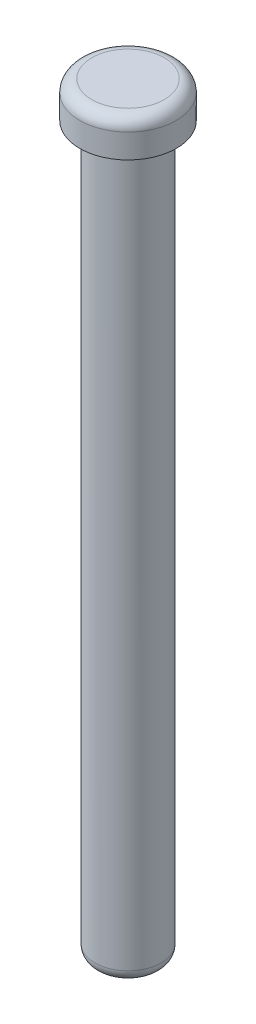
ISO-10303-21;
HEADER;
FILE_DESCRIPTION(('STEP AP214'),'2;1');
FILE_NAME('part.step','',(''),(''),'','','');
FILE_SCHEMA(('AUTOMOTIVE_DESIGN { 1 0 10303 214 1 1 1 1 }'));
ENDSEC;
DATA;
#1=APPLICATION_CONTEXT('core data for automotive mechanical design processes');
#2=APPLICATION_PROTOCOL_DEFINITION('international standard','automotive_design',2000,#1);
#3=PRODUCT_CONTEXT('',#1,'mechanical');
#4=PRODUCT('Part','Part','',(#3));
#5=PRODUCT_RELATED_PRODUCT_CATEGORY('part','',(#4));
#6=PRODUCT_DEFINITION_FORMATION('','',#4);
#7=PRODUCT_DEFINITION_CONTEXT('part definition',#1,'design');
#8=PRODUCT_DEFINITION('design','',#6,#7);
#9=PRODUCT_DEFINITION_SHAPE('','',#8);
#10=(LENGTH_UNIT() NAMED_UNIT(*) SI_UNIT(.MILLI.,.METRE.));
#11=(NAMED_UNIT(*) PLANE_ANGLE_UNIT() SI_UNIT($,.RADIAN.));
#12=(NAMED_UNIT(*) SI_UNIT($,.STERADIAN.) SOLID_ANGLE_UNIT());
#13=UNCERTAINTY_MEASURE_WITH_UNIT(LENGTH_MEASURE(1.E-05),#10,'distance_accuracy_value','');
#14=(GEOMETRIC_REPRESENTATION_CONTEXT(3) GLOBAL_UNCERTAINTY_ASSIGNED_CONTEXT((#13)) GLOBAL_UNIT_ASSIGNED_CONTEXT((#10,
#11,#12)) REPRESENTATION_CONTEXT('',''));
#15=CARTESIAN_POINT('',(0.,0.,0.));
#16=DIRECTION('',(0.,0.,1.));
#17=DIRECTION('',(1.,0.,0.));
#18=AXIS2_PLACEMENT_3D('',#15,#16,#17);
#19=CARTESIAN_POINT('',(-2.75,0.,0.));
#20=DIRECTION('',(0.,1.,0.));
#21=DIRECTION('',(0.,0.,1.));
#22=AXIS2_PLACEMENT_3D('',#19,#20,#21);
#23=PLANE('',#22);
#24=CARTESIAN_POINT('',(0.,0.,0.));
#25=DIRECTION('',(0.,1.,0.));
#26=DIRECTION('',(0.,0.,1.));
#27=AXIS2_PLACEMENT_3D('',#24,#25,#26);
#28=CIRCLE('',#27,1.75);
#29=CARTESIAN_POINT('',(0.,0.,1.75));
#30=VERTEX_POINT('',#29);
#31=EDGE_CURVE('E55',#30,#30,#28,.F.);
#32=ORIENTED_EDGE('',*,*,#31,.T.);
#33=EDGE_LOOP('',(#32));
#34=FACE_BOUND('',#33,.T.);
#35=ADVANCED_FACE('F37',(#34),#23,.F.);
#36=CARTESIAN_POINT('',(0.,63.,0.));
#37=DIRECTION('',(0.,-1.,0.));
#38=DIRECTION('',(0.,0.,-1.));
#39=AXIS2_PLACEMENT_3D('',#36,#37,#38);
#40=PLANE('',#39);
#41=CARTESIAN_POINT('',(0.,63.,0.));
#42=DIRECTION('',(0.,-1.,0.));
#43=DIRECTION('',(0.,0.,-1.));
#44=AXIS2_PLACEMENT_3D('',#41,#42,#43);
#45=CIRCLE('',#44,3.);
#46=CARTESIAN_POINT('',(0.,63.,-3.));
#47=VERTEX_POINT('',#46);
#48=EDGE_CURVE('E10',#47,#47,#45,.F.);
#49=ORIENTED_EDGE('',*,*,#48,.T.);
#50=EDGE_LOOP('',(#49));
#51=FACE_BOUND('',#50,.T.);
#52=ADVANCED_FACE('F80',(#51),#40,.F.);
#53=CARTESIAN_POINT('',(0.,0.,0.));
#54=DIRECTION('',(0.,-1.,0.));
#55=DIRECTION('',(0.,0.,-1.));
#56=AXIS2_PLACEMENT_3D('',#53,#54,#55);
#57=CYLINDRICAL_SURFACE('',#56,4.);
#58=CARTESIAN_POINT('',(0.,62.,0.));
#59=DIRECTION('',(0.,-1.,0.));
#60=DIRECTION('',(0.,0.,-1.));
#61=AXIS2_PLACEMENT_3D('',#58,#59,#60);
#62=CIRCLE('',#61,4.);
#63=CARTESIAN_POINT('',(0.,62.,-4.));
#64=VERTEX_POINT('',#63);
#65=EDGE_CURVE('E45',#64,#64,#62,.T.);
#66=ORIENTED_EDGE('',*,*,#65,.T.);
#67=EDGE_LOOP('',(#66));
#68=FACE_BOUND('',#67,.T.);
#69=CARTESIAN_POINT('',(0.,60.,0.));
#70=DIRECTION('',(0.,-1.,0.));
#71=DIRECTION('',(0.,0.,-1.));
#72=AXIS2_PLACEMENT_3D('',#69,#70,#71);
#73=CIRCLE('',#72,4.);
#74=CARTESIAN_POINT('',(0.,60.,-4.));
#75=VERTEX_POINT('',#74);
#76=EDGE_CURVE('E61',#75,#75,#73,.T.);
#77=ORIENTED_EDGE('',*,*,#76,.F.);
#78=EDGE_LOOP('',(#77));
#79=FACE_BOUND('',#78,.T.);
#80=ADVANCED_FACE('F75',(#68,#79),#57,.T.);
#81=CARTESIAN_POINT('',(-4.,60.,0.));
#82=DIRECTION('',(0.,1.,0.));
#83=DIRECTION('',(0.,0.,1.));
#84=AXIS2_PLACEMENT_3D('',#81,#82,#83);
#85=PLANE('',#84);
#86=CARTESIAN_POINT('',(0.,60.,0.));
#87=DIRECTION('',(0.,-1.,0.));
#88=DIRECTION('',(0.,0.,-1.));
#89=AXIS2_PLACEMENT_3D('',#86,#87,#88);
#90=CIRCLE('',#89,2.75000000000001);
#91=CARTESIAN_POINT('',(0.,60.,-2.75000000000001));
#92=VERTEX_POINT('',#91);
#93=EDGE_CURVE('E65',#92,#92,#90,.T.);
#94=ORIENTED_EDGE('',*,*,#93,.F.);
#95=EDGE_LOOP('',(#94));
#96=FACE_BOUND('',#95,.T.);
#97=ORIENTED_EDGE('',*,*,#76,.T.);
#98=EDGE_LOOP('',(#97));
#99=FACE_BOUND('',#98,.T.);
#100=ADVANCED_FACE('F72',(#96,#99),#85,.F.);
#101=CARTESIAN_POINT('',(0.,0.,0.));
#102=DIRECTION('',(0.,-1.,0.));
#103=DIRECTION('',(0.,0.,-1.));
#104=AXIS2_PLACEMENT_3D('',#101,#102,#103);
#105=CYLINDRICAL_SURFACE('',#104,2.75);
#106=CARTESIAN_POINT('',(0.,1.,0.));
#107=DIRECTION('',(0.,1.,0.));
#108=DIRECTION('',(0.,0.,1.));
#109=AXIS2_PLACEMENT_3D('',#106,#107,#108);
#110=CIRCLE('',#109,2.75);
#111=CARTESIAN_POINT('',(0.,1.,2.75));
#112=VERTEX_POINT('',#111);
#113=EDGE_CURVE('E50',#112,#112,#110,.T.);
#114=ORIENTED_EDGE('',*,*,#113,.T.);
#115=EDGE_LOOP('',(#114));
#116=FACE_BOUND('',#115,.T.);
#117=ORIENTED_EDGE('',*,*,#93,.T.);
#118=EDGE_LOOP('',(#117));
#119=FACE_BOUND('',#118,.T.);
#120=ADVANCED_FACE('F70',(#116,#119),#105,.T.);
#121=CARTESIAN_POINT('',(0.,1.,0.));
#122=DIRECTION('',(0.,1.,0.));
#123=DIRECTION('',(0.,0.,1.));
#124=AXIS2_PLACEMENT_3D('',#121,#122,#123);
#125=TOROIDAL_SURFACE('',#124,1.75,1.);
#126=ORIENTED_EDGE('',*,*,#113,.F.);
#127=EDGE_LOOP('',(#126));
#128=FACE_BOUND('',#127,.T.);
#129=ORIENTED_EDGE('',*,*,#31,.F.);
#130=EDGE_LOOP('',(#129));
#131=FACE_BOUND('',#130,.T.);
#132=ADVANCED_FACE('F91',(#128,#131),#125,.T.);
#133=CARTESIAN_POINT('',(0.,62.,0.));
#134=DIRECTION('',(0.,-1.,0.));
#135=DIRECTION('',(0.,0.,-1.));
#136=AXIS2_PLACEMENT_3D('',#133,#134,#135);
#137=TOROIDAL_SURFACE('',#136,3.,1.);
#138=ORIENTED_EDGE('',*,*,#48,.F.);
#139=EDGE_LOOP('',(#138));
#140=FACE_BOUND('',#139,.T.);
#141=ORIENTED_EDGE('',*,*,#65,.F.);
#142=EDGE_LOOP('',(#141));
#143=FACE_BOUND('',#142,.T.);
#144=ADVANCED_FACE('F39',(#140,#143),#137,.T.);
#145=CLOSED_SHELL('',(#35,#52,#80,#100,#120,#132,#144));
#146=MANIFOLD_SOLID_BREP('B2',#145);
#147=ADVANCED_BREP_SHAPE_REPRESENTATION('',(#18,#146),#14);
#148=SHAPE_DEFINITION_REPRESENTATION(#9,#147);
ENDSEC;
END-ISO-10303-21;
